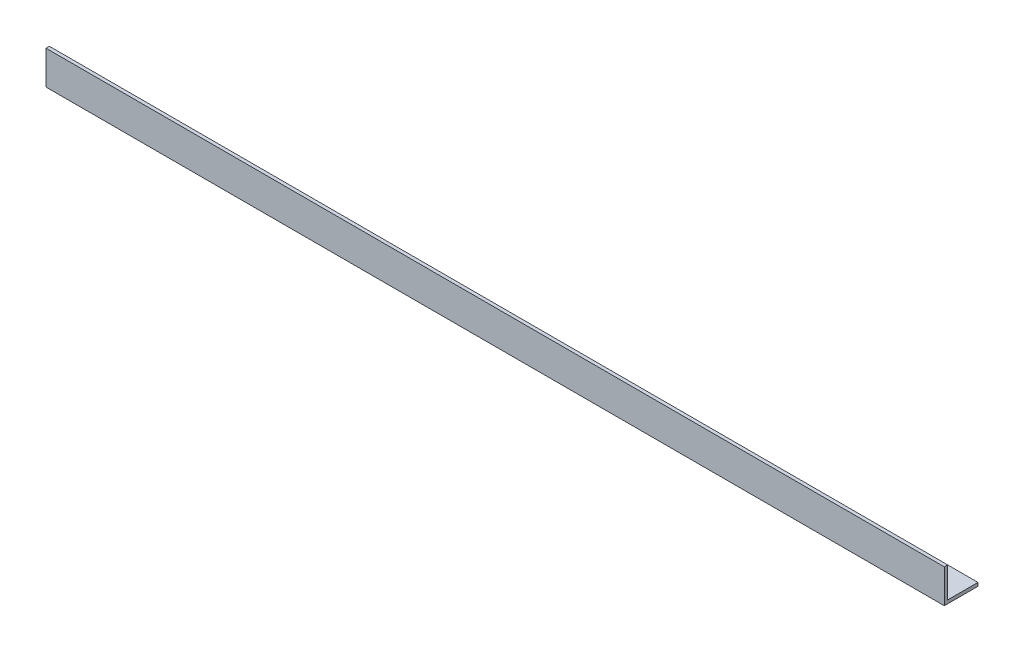
ISO-10303-21;
HEADER;
FILE_DESCRIPTION(('STEP AP214'),'2;1');
FILE_NAME('part.step','',(''),(''),'','','');
FILE_SCHEMA(('AUTOMOTIVE_DESIGN { 1 0 10303 214 1 1 1 1 }'));
ENDSEC;
DATA;
#1=APPLICATION_CONTEXT('core data for automotive mechanical design processes');
#2=APPLICATION_PROTOCOL_DEFINITION('international standard','automotive_design',2000,#1);
#3=PRODUCT_CONTEXT('',#1,'mechanical');
#4=PRODUCT('Part','Part','',(#3));
#5=PRODUCT_RELATED_PRODUCT_CATEGORY('part','',(#4));
#6=PRODUCT_DEFINITION_FORMATION('','',#4);
#7=PRODUCT_DEFINITION_CONTEXT('part definition',#1,'design');
#8=PRODUCT_DEFINITION('design','',#6,#7);
#9=PRODUCT_DEFINITION_SHAPE('','',#8);
#10=(LENGTH_UNIT() NAMED_UNIT(*) SI_UNIT(.MILLI.,.METRE.));
#11=(NAMED_UNIT(*) PLANE_ANGLE_UNIT() SI_UNIT($,.RADIAN.));
#12=(NAMED_UNIT(*) SI_UNIT($,.STERADIAN.) SOLID_ANGLE_UNIT());
#13=UNCERTAINTY_MEASURE_WITH_UNIT(LENGTH_MEASURE(1.E-05),#10,'distance_accuracy_value','');
#14=(GEOMETRIC_REPRESENTATION_CONTEXT(3) GLOBAL_UNCERTAINTY_ASSIGNED_CONTEXT((#13)) GLOBAL_UNIT_ASSIGNED_CONTEXT((#10,
#11,#12)) REPRESENTATION_CONTEXT('',''));
#15=CARTESIAN_POINT('',(0.,0.,0.));
#16=DIRECTION('',(0.,0.,1.));
#17=DIRECTION('',(1.,0.,0.));
#18=AXIS2_PLACEMENT_3D('',#15,#16,#17);
#19=CARTESIAN_POINT('',(400.,0.,-15.));
#20=DIRECTION('',(0.,1.,0.));
#21=DIRECTION('',(0.,0.,1.));
#22=AXIS2_PLACEMENT_3D('',#19,#20,#21);
#23=PLANE('',#22);
#24=DIRECTION('',(0.,0.,-1.));
#25=VECTOR('',#24,1.);
#26=CARTESIAN_POINT('',(0.,0.,-15.));
#27=LINE('',#26,#25);
#28=CARTESIAN_POINT('',(0.,0.,0.));
#29=VERTEX_POINT('',#28);
#30=CARTESIAN_POINT('',(0.,0.,-15.));
#31=VERTEX_POINT('',#30);
#32=EDGE_CURVE('E118',#29,#31,#27,.T.);
#33=ORIENTED_EDGE('',*,*,#32,.T.);
#34=DIRECTION('',(-1.,0.,0.));
#35=VECTOR('',#34,1.);
#36=CARTESIAN_POINT('',(400.,0.,-15.));
#37=LINE('',#36,#35);
#38=CARTESIAN_POINT('',(400.,0.,-15.));
#39=VERTEX_POINT('',#38);
#40=EDGE_CURVE('E11',#39,#31,#37,.T.);
#41=ORIENTED_EDGE('',*,*,#40,.F.);
#42=DIRECTION('',(0.,0.,-1.));
#43=VECTOR('',#42,1.);
#44=CARTESIAN_POINT('',(400.,0.,-15.));
#45=LINE('',#44,#43);
#46=CARTESIAN_POINT('',(400.,0.,0.));
#47=VERTEX_POINT('',#46);
#48=EDGE_CURVE('E128',#47,#39,#45,.T.);
#49=ORIENTED_EDGE('',*,*,#48,.F.);
#50=DIRECTION('',(-1.,0.,0.));
#51=VECTOR('',#50,1.);
#52=CARTESIAN_POINT('',(400.,0.,0.));
#53=LINE('',#52,#51);
#54=EDGE_CURVE('E114',#47,#29,#53,.T.);
#55=ORIENTED_EDGE('',*,*,#54,.T.);
#56=EDGE_LOOP('',(#33,#41,#49,#55));
#57=FACE_BOUND('',#56,.T.);
#58=ADVANCED_FACE('F34',(#57),#23,.F.);
#59=CARTESIAN_POINT('',(400.,1.49999999999998,-15.));
#60=DIRECTION('',(0.,0.,1.));
#61=DIRECTION('',(1.,0.,0.));
#62=AXIS2_PLACEMENT_3D('',#59,#60,#61);
#63=PLANE('',#62);
#64=DIRECTION('',(0.,1.,0.));
#65=VECTOR('',#64,1.);
#66=CARTESIAN_POINT('',(0.,1.49999999999998,-15.));
#67=LINE('',#66,#65);
#68=CARTESIAN_POINT('',(0.,1.49999999999998,-15.));
#69=VERTEX_POINT('',#68);
#70=EDGE_CURVE('E121',#31,#69,#67,.T.);
#71=ORIENTED_EDGE('',*,*,#70,.T.);
#72=DIRECTION('',(-1.,0.,0.));
#73=VECTOR('',#72,1.);
#74=CARTESIAN_POINT('',(400.,1.49999999999998,-15.));
#75=LINE('',#74,#73);
#76=CARTESIAN_POINT('',(400.,1.49999999999998,-15.));
#77=VERTEX_POINT('',#76);
#78=EDGE_CURVE('E42',#77,#69,#75,.T.);
#79=ORIENTED_EDGE('',*,*,#78,.F.);
#80=DIRECTION('',(0.,1.,0.));
#81=VECTOR('',#80,1.);
#82=CARTESIAN_POINT('',(400.,1.49999999999998,-15.));
#83=LINE('',#82,#81);
#84=EDGE_CURVE('E87',#39,#77,#83,.T.);
#85=ORIENTED_EDGE('',*,*,#84,.F.);
#86=ORIENTED_EDGE('',*,*,#40,.T.);
#87=EDGE_LOOP('',(#71,#79,#85,#86));
#88=FACE_BOUND('',#87,.T.);
#89=ADVANCED_FACE('F152',(#88),#63,.F.);
#90=CARTESIAN_POINT('',(400.,1.5,-1.50000000000002));
#91=DIRECTION('',(0.,-1.,0.));
#92=DIRECTION('',(0.,0.,-1.));
#93=AXIS2_PLACEMENT_3D('',#90,#91,#92);
#94=PLANE('',#93);
#95=DIRECTION('',(0.,0.,1.));
#96=VECTOR('',#95,1.);
#97=CARTESIAN_POINT('',(0.,1.5,-1.50000000000002));
#98=LINE('',#97,#96);
#99=CARTESIAN_POINT('',(0.,1.5,-1.50000000000002));
#100=VERTEX_POINT('',#99);
#101=EDGE_CURVE('E123',#69,#100,#98,.T.);
#102=ORIENTED_EDGE('',*,*,#101,.T.);
#103=DIRECTION('',(-1.,0.,0.));
#104=VECTOR('',#103,1.);
#105=CARTESIAN_POINT('',(400.,1.5,-1.50000000000002));
#106=LINE('',#105,#104);
#107=CARTESIAN_POINT('',(400.,1.5,-1.50000000000002));
#108=VERTEX_POINT('',#107);
#109=EDGE_CURVE('E109',#108,#100,#106,.T.);
#110=ORIENTED_EDGE('',*,*,#109,.F.);
#111=DIRECTION('',(0.,0.,1.));
#112=VECTOR('',#111,1.);
#113=CARTESIAN_POINT('',(400.,1.5,-1.50000000000002));
#114=LINE('',#113,#112);
#115=EDGE_CURVE('E100',#77,#108,#114,.T.);
#116=ORIENTED_EDGE('',*,*,#115,.F.);
#117=ORIENTED_EDGE('',*,*,#78,.T.);
#118=EDGE_LOOP('',(#102,#110,#116,#117));
#119=FACE_BOUND('',#118,.T.);
#120=ADVANCED_FACE('F134',(#119),#94,.F.);
#121=CARTESIAN_POINT('',(400.,15.,-1.5));
#122=DIRECTION('',(0.,0.,1.));
#123=DIRECTION('',(0.,-1.,0.));
#124=AXIS2_PLACEMENT_3D('',#121,#122,#123);
#125=PLANE('',#124);
#126=DIRECTION('',(0.,1.,0.));
#127=VECTOR('',#126,1.);
#128=CARTESIAN_POINT('',(0.,15.,-1.5));
#129=LINE('',#128,#127);
#130=CARTESIAN_POINT('',(0.,15.,-1.5));
#131=VERTEX_POINT('',#130);
#132=EDGE_CURVE('E108',#100,#131,#129,.T.);
#133=ORIENTED_EDGE('',*,*,#132,.T.);
#134=DIRECTION('',(-1.,0.,0.));
#135=VECTOR('',#134,1.);
#136=CARTESIAN_POINT('',(400.,15.,-1.5));
#137=LINE('',#136,#135);
#138=CARTESIAN_POINT('',(400.,15.,-1.5));
#139=VERTEX_POINT('',#138);
#140=EDGE_CURVE('E105',#139,#131,#137,.T.);
#141=ORIENTED_EDGE('',*,*,#140,.F.);
#142=DIRECTION('',(0.,1.,0.));
#143=VECTOR('',#142,1.);
#144=CARTESIAN_POINT('',(400.,15.,-1.5));
#145=LINE('',#144,#143);
#146=EDGE_CURVE('E94',#108,#139,#145,.T.);
#147=ORIENTED_EDGE('',*,*,#146,.F.);
#148=ORIENTED_EDGE('',*,*,#109,.T.);
#149=EDGE_LOOP('',(#133,#141,#147,#148));
#150=FACE_BOUND('',#149,.T.);
#151=ADVANCED_FACE('F106',(#150),#125,.F.);
#152=CARTESIAN_POINT('',(400.,15.,0.));
#153=DIRECTION('',(0.,-1.,0.));
#154=DIRECTION('',(0.,0.,-1.));
#155=AXIS2_PLACEMENT_3D('',#152,#153,#154);
#156=PLANE('',#155);
#157=DIRECTION('',(0.,0.,1.));
#158=VECTOR('',#157,1.);
#159=CARTESIAN_POINT('',(0.,15.,0.));
#160=LINE('',#159,#158);
#161=CARTESIAN_POINT('',(0.,15.,0.));
#162=VERTEX_POINT('',#161);
#163=EDGE_CURVE('E73',#131,#162,#160,.T.);
#164=ORIENTED_EDGE('',*,*,#163,.T.);
#165=DIRECTION('',(-1.,0.,0.));
#166=VECTOR('',#165,1.);
#167=CARTESIAN_POINT('',(400.,15.,0.));
#168=LINE('',#167,#166);
#169=CARTESIAN_POINT('',(400.,15.,0.));
#170=VERTEX_POINT('',#169);
#171=EDGE_CURVE('E110',#170,#162,#168,.T.);
#172=ORIENTED_EDGE('',*,*,#171,.F.);
#173=DIRECTION('',(0.,0.,1.));
#174=VECTOR('',#173,1.);
#175=CARTESIAN_POINT('',(400.,15.,0.));
#176=LINE('',#175,#174);
#177=EDGE_CURVE('E98',#139,#170,#176,.T.);
#178=ORIENTED_EDGE('',*,*,#177,.F.);
#179=ORIENTED_EDGE('',*,*,#140,.T.);
#180=EDGE_LOOP('',(#164,#172,#178,#179));
#181=FACE_BOUND('',#180,.T.);
#182=ADVANCED_FACE('F112',(#181),#156,.F.);
#183=CARTESIAN_POINT('',(400.,0.,0.));
#184=DIRECTION('',(0.,0.,-1.));
#185=DIRECTION('',(-1.,0.,0.));
#186=AXIS2_PLACEMENT_3D('',#183,#184,#185);
#187=PLANE('',#186);
#188=DIRECTION('',(0.,-1.,0.));
#189=VECTOR('',#188,1.);
#190=CARTESIAN_POINT('',(0.,0.,0.));
#191=LINE('',#190,#189);
#192=EDGE_CURVE('E79',#162,#29,#191,.T.);
#193=ORIENTED_EDGE('',*,*,#192,.T.);
#194=ORIENTED_EDGE('',*,*,#54,.F.);
#195=DIRECTION('',(0.,-1.,0.));
#196=VECTOR('',#195,1.);
#197=CARTESIAN_POINT('',(400.,0.,0.));
#198=LINE('',#197,#196);
#199=EDGE_CURVE('E50',#170,#47,#198,.T.);
#200=ORIENTED_EDGE('',*,*,#199,.F.);
#201=ORIENTED_EDGE('',*,*,#171,.T.);
#202=EDGE_LOOP('',(#193,#194,#200,#201));
#203=FACE_BOUND('',#202,.T.);
#204=ADVANCED_FACE('F141',(#203),#187,.F.);
#205=CARTESIAN_POINT('',(400.,0.,0.));
#206=DIRECTION('',(-1.,0.,0.));
#207=DIRECTION('',(0.,0.,1.));
#208=AXIS2_PLACEMENT_3D('',#205,#206,#207);
#209=PLANE('',#208);
#210=ORIENTED_EDGE('',*,*,#48,.T.);
#211=ORIENTED_EDGE('',*,*,#84,.T.);
#212=ORIENTED_EDGE('',*,*,#115,.T.);
#213=ORIENTED_EDGE('',*,*,#146,.T.);
#214=ORIENTED_EDGE('',*,*,#177,.T.);
#215=ORIENTED_EDGE('',*,*,#199,.T.);
#216=EDGE_LOOP('',(#210,#211,#212,#213,#214,#215));
#217=FACE_BOUND('',#216,.T.);
#218=ADVANCED_FACE('F96',(#217),#209,.F.);
#219=CARTESIAN_POINT('',(0.,0.,0.));
#220=DIRECTION('',(-1.,0.,0.));
#221=DIRECTION('',(0.,0.,1.));
#222=AXIS2_PLACEMENT_3D('',#219,#220,#221);
#223=PLANE('',#222);
#224=ORIENTED_EDGE('',*,*,#32,.F.);
#225=ORIENTED_EDGE('',*,*,#192,.F.);
#226=ORIENTED_EDGE('',*,*,#163,.F.);
#227=ORIENTED_EDGE('',*,*,#132,.F.);
#228=ORIENTED_EDGE('',*,*,#101,.F.);
#229=ORIENTED_EDGE('',*,*,#70,.F.);
#230=EDGE_LOOP('',(#224,#225,#226,#227,#228,#229));
#231=FACE_BOUND('',#230,.T.);
#232=ADVANCED_FACE('F137',(#231),#223,.T.);
#233=CLOSED_SHELL('',(#58,#89,#120,#151,#182,#204,#218,#232));
#234=MANIFOLD_SOLID_BREP('B2',#233);
#235=ADVANCED_BREP_SHAPE_REPRESENTATION('',(#18,#234),#14);
#236=SHAPE_DEFINITION_REPRESENTATION(#9,#235);
ENDSEC;
END-ISO-10303-21;
